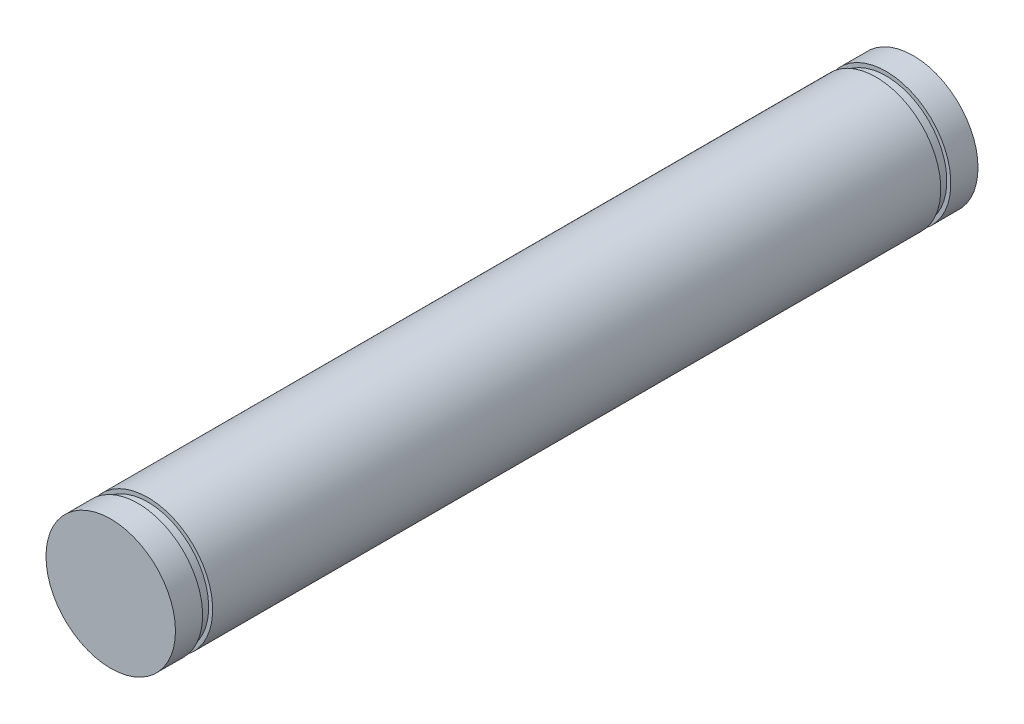
ISO-10303-21;
HEADER;
FILE_DESCRIPTION(('STEP AP214'),'2;1');
FILE_NAME('part.step','',(''),(''),'','','');
FILE_SCHEMA(('AUTOMOTIVE_DESIGN { 1 0 10303 214 1 1 1 1 }'));
ENDSEC;
DATA;
#1=APPLICATION_CONTEXT('core data for automotive mechanical design processes');
#2=APPLICATION_PROTOCOL_DEFINITION('international standard','automotive_design',2000,#1);
#3=PRODUCT_CONTEXT('',#1,'mechanical');
#4=PRODUCT('Part','Part','',(#3));
#5=PRODUCT_RELATED_PRODUCT_CATEGORY('part','',(#4));
#6=PRODUCT_DEFINITION_FORMATION('','',#4);
#7=PRODUCT_DEFINITION_CONTEXT('part definition',#1,'design');
#8=PRODUCT_DEFINITION('design','',#6,#7);
#9=PRODUCT_DEFINITION_SHAPE('','',#8);
#10=(LENGTH_UNIT() NAMED_UNIT(*) SI_UNIT(.MILLI.,.METRE.));
#11=(NAMED_UNIT(*) PLANE_ANGLE_UNIT() SI_UNIT($,.RADIAN.));
#12=(NAMED_UNIT(*) SI_UNIT($,.STERADIAN.) SOLID_ANGLE_UNIT());
#13=UNCERTAINTY_MEASURE_WITH_UNIT(LENGTH_MEASURE(1.E-05),#10,'distance_accuracy_value','');
#14=(GEOMETRIC_REPRESENTATION_CONTEXT(3) GLOBAL_UNCERTAINTY_ASSIGNED_CONTEXT((#13)) GLOBAL_UNIT_ASSIGNED_CONTEXT((#10,
#11,#12)) REPRESENTATION_CONTEXT('',''));
#15=CARTESIAN_POINT('',(0.,0.,0.));
#16=DIRECTION('',(0.,0.,1.));
#17=DIRECTION('',(1.,0.,0.));
#18=AXIS2_PLACEMENT_3D('',#15,#16,#17);
#19=CARTESIAN_POINT('',(0.,0.,59.05));
#20=DIRECTION('',(0.,0.,-1.));
#21=DIRECTION('',(-1.,0.,0.));
#22=AXIS2_PLACEMENT_3D('',#19,#20,#21);
#23=CYLINDRICAL_SURFACE('',#22,4.7625);
#24=CARTESIAN_POINT('',(0.,0.,2.));
#25=DIRECTION('',(0.,0.,-1.));
#26=DIRECTION('',(-1.,0.,0.));
#27=AXIS2_PLACEMENT_3D('',#24,#25,#26);
#28=CIRCLE('',#27,4.7625);
#29=CARTESIAN_POINT('',(-4.7625,0.,2.));
#30=VERTEX_POINT('',#29);
#31=EDGE_CURVE('E58',#30,#30,#28,.T.);
#32=ORIENTED_EDGE('',*,*,#31,.T.);
#33=EDGE_LOOP('',(#32));
#34=FACE_BOUND('',#33,.T.);
#35=CARTESIAN_POINT('',(0.,0.,0.));
#36=DIRECTION('',(0.,0.,1.));
#37=DIRECTION('',(1.,0.,0.));
#38=AXIS2_PLACEMENT_3D('',#35,#36,#37);
#39=CIRCLE('',#38,4.7625);
#40=CARTESIAN_POINT('',(4.7625,0.,0.));
#41=VERTEX_POINT('',#40);
#42=EDGE_CURVE('E51',#41,#41,#39,.T.);
#43=ORIENTED_EDGE('',*,*,#42,.T.);
#44=EDGE_LOOP('',(#43));
#45=FACE_BOUND('',#44,.T.);
#46=ADVANCED_FACE('F47',(#34,#45),#23,.T.);
#47=CARTESIAN_POINT('',(0.,0.,0.));
#48=DIRECTION('',(0.,0.,1.));
#49=DIRECTION('',(1.,0.,0.));
#50=AXIS2_PLACEMENT_3D('',#47,#48,#49);
#51=PLANE('',#50);
#52=ORIENTED_EDGE('',*,*,#42,.F.);
#53=EDGE_LOOP('',(#52));
#54=FACE_BOUND('',#53,.T.);
#55=ADVANCED_FACE('F117',(#54),#51,.F.);
#56=CARTESIAN_POINT('',(-4.7625,0.,2.));
#57=DIRECTION('',(0.,0.,-1.));
#58=DIRECTION('',(-1.,0.,0.));
#59=AXIS2_PLACEMENT_3D('',#56,#57,#58);
#60=PLANE('',#59);
#61=ORIENTED_EDGE('',*,*,#31,.F.);
#62=EDGE_LOOP('',(#61));
#63=FACE_BOUND('',#62,.T.);
#64=CARTESIAN_POINT('',(0.,0.,2.));
#65=DIRECTION('',(0.,0.,-1.));
#66=DIRECTION('',(-1.,0.,0.));
#67=AXIS2_PLACEMENT_3D('',#64,#65,#66);
#68=CIRCLE('',#67,4.4704);
#69=CARTESIAN_POINT('',(-4.4704,0.,2.));
#70=VERTEX_POINT('',#69);
#71=EDGE_CURVE('E75',#70,#70,#68,.T.);
#72=ORIENTED_EDGE('',*,*,#71,.T.);
#73=EDGE_LOOP('',(#72));
#74=FACE_BOUND('',#73,.T.);
#75=ADVANCED_FACE('F123',(#63,#74),#60,.F.);
#76=CARTESIAN_POINT('',(0.,0.,0.));
#77=DIRECTION('',(0.,0.,-1.));
#78=DIRECTION('',(-1.,0.,0.));
#79=AXIS2_PLACEMENT_3D('',#76,#77,#78);
#80=CYLINDRICAL_SURFACE('',#79,4.4704);
#81=ORIENTED_EDGE('',*,*,#71,.F.);
#82=EDGE_LOOP('',(#81));
#83=FACE_BOUND('',#82,.T.);
#84=CARTESIAN_POINT('',(0.,0.,2.7366));
#85=DIRECTION('',(0.,0.,-1.));
#86=DIRECTION('',(-1.,0.,0.));
#87=AXIS2_PLACEMENT_3D('',#84,#85,#86);
#88=CIRCLE('',#87,4.4704);
#89=CARTESIAN_POINT('',(-4.4704,0.,2.7366));
#90=VERTEX_POINT('',#89);
#91=EDGE_CURVE('E78',#90,#90,#88,.T.);
#92=ORIENTED_EDGE('',*,*,#91,.T.);
#93=EDGE_LOOP('',(#92));
#94=FACE_BOUND('',#93,.T.);
#95=ADVANCED_FACE('F130',(#83,#94),#80,.T.);
#96=CARTESIAN_POINT('',(-4.4704,0.,2.7366));
#97=DIRECTION('',(0.,0.,1.));
#98=DIRECTION('',(1.,0.,0.));
#99=AXIS2_PLACEMENT_3D('',#96,#97,#98);
#100=PLANE('',#99);
#101=ORIENTED_EDGE('',*,*,#91,.F.);
#102=EDGE_LOOP('',(#101));
#103=FACE_BOUND('',#102,.T.);
#104=CARTESIAN_POINT('',(0.,0.,2.7366));
#105=DIRECTION('',(0.,0.,-1.));
#106=DIRECTION('',(-1.,0.,0.));
#107=AXIS2_PLACEMENT_3D('',#104,#105,#106);
#108=CIRCLE('',#107,4.7625);
#109=CARTESIAN_POINT('',(-4.7625,0.,2.7366));
#110=VERTEX_POINT('',#109);
#111=EDGE_CURVE('E63',#110,#110,#108,.T.);
#112=ORIENTED_EDGE('',*,*,#111,.T.);
#113=EDGE_LOOP('',(#112));
#114=FACE_BOUND('',#113,.T.);
#115=ADVANCED_FACE('F84',(#103,#114),#100,.F.);
#116=ORIENTED_EDGE('',*,*,#111,.F.);
#117=EDGE_LOOP('',(#116));
#118=FACE_BOUND('',#117,.T.);
#119=CARTESIAN_POINT('',(0.,0.,56.3134));
#120=DIRECTION('',(0.,0.,-1.));
#121=DIRECTION('',(-1.,0.,0.));
#122=AXIS2_PLACEMENT_3D('',#119,#120,#121);
#123=CIRCLE('',#122,4.7625);
#124=CARTESIAN_POINT('',(-4.7625,0.,56.3134));
#125=VERTEX_POINT('',#124);
#126=EDGE_CURVE('E64',#125,#125,#123,.T.);
#127=ORIENTED_EDGE('',*,*,#126,.T.);
#128=EDGE_LOOP('',(#127));
#129=FACE_BOUND('',#128,.T.);
#130=ADVANCED_FACE('F86',(#118,#129),#23,.T.);
#131=CARTESIAN_POINT('',(0.,0.,0.));
#132=DIRECTION('',(0.,0.,-1.));
#133=DIRECTION('',(-1.,0.,0.));
#134=AXIS2_PLACEMENT_3D('',#131,#132,#133);
#135=CYLINDRICAL_SURFACE('',#134,4.47039999999999);
#136=CARTESIAN_POINT('',(0.,0.,56.3134));
#137=DIRECTION('',(0.,0.,-1.));
#138=DIRECTION('',(-1.,0.,0.));
#139=AXIS2_PLACEMENT_3D('',#136,#137,#138);
#140=CIRCLE('',#139,4.47039999999999);
#141=CARTESIAN_POINT('',(-4.47039999999999,0.,56.3134));
#142=VERTEX_POINT('',#141);
#143=EDGE_CURVE('E60',#142,#142,#140,.T.);
#144=ORIENTED_EDGE('',*,*,#143,.F.);
#145=EDGE_LOOP('',(#144));
#146=FACE_BOUND('',#145,.T.);
#147=CARTESIAN_POINT('',(0.,0.,57.05));
#148=DIRECTION('',(0.,0.,-1.));
#149=DIRECTION('',(-1.,0.,0.));
#150=AXIS2_PLACEMENT_3D('',#147,#148,#149);
#151=CIRCLE('',#150,4.47039999999999);
#152=CARTESIAN_POINT('',(-4.47039999999999,0.,57.05));
#153=VERTEX_POINT('',#152);
#154=EDGE_CURVE('E70',#153,#153,#151,.T.);
#155=ORIENTED_EDGE('',*,*,#154,.T.);
#156=EDGE_LOOP('',(#155));
#157=FACE_BOUND('',#156,.T.);
#158=ADVANCED_FACE('F89',(#146,#157),#135,.T.);
#159=CARTESIAN_POINT('',(-4.47039999999999,0.,56.3134));
#160=DIRECTION('',(0.,0.,-1.));
#161=DIRECTION('',(-1.,0.,0.));
#162=AXIS2_PLACEMENT_3D('',#159,#160,#161);
#163=PLANE('',#162);
#164=ORIENTED_EDGE('',*,*,#126,.F.);
#165=EDGE_LOOP('',(#164));
#166=FACE_BOUND('',#165,.T.);
#167=ORIENTED_EDGE('',*,*,#143,.T.);
#168=EDGE_LOOP('',(#167));
#169=FACE_BOUND('',#168,.T.);
#170=ADVANCED_FACE('F92',(#166,#169),#163,.F.);
#171=CARTESIAN_POINT('',(-4.7625,0.,57.05));
#172=DIRECTION('',(0.,0.,1.));
#173=DIRECTION('',(1.,0.,0.));
#174=AXIS2_PLACEMENT_3D('',#171,#172,#173);
#175=PLANE('',#174);
#176=ORIENTED_EDGE('',*,*,#154,.F.);
#177=EDGE_LOOP('',(#176));
#178=FACE_BOUND('',#177,.T.);
#179=CARTESIAN_POINT('',(0.,0.,57.05));
#180=DIRECTION('',(0.,0.,-1.));
#181=DIRECTION('',(-1.,0.,0.));
#182=AXIS2_PLACEMENT_3D('',#179,#180,#181);
#183=CIRCLE('',#182,4.7625);
#184=CARTESIAN_POINT('',(-4.7625,0.,57.05));
#185=VERTEX_POINT('',#184);
#186=EDGE_CURVE('E67',#185,#185,#183,.T.);
#187=ORIENTED_EDGE('',*,*,#186,.T.);
#188=EDGE_LOOP('',(#187));
#189=FACE_BOUND('',#188,.T.);
#190=ADVANCED_FACE('F95',(#178,#189),#175,.F.);
#191=CARTESIAN_POINT('',(0.,0.,59.05));
#192=DIRECTION('',(0.,0.,1.));
#193=DIRECTION('',(1.,0.,0.));
#194=AXIS2_PLACEMENT_3D('',#191,#192,#193);
#195=PLANE('',#194);
#196=CARTESIAN_POINT('',(0.,0.,59.05));
#197=DIRECTION('',(0.,0.,1.));
#198=DIRECTION('',(1.,0.,0.));
#199=AXIS2_PLACEMENT_3D('',#196,#197,#198);
#200=CIRCLE('',#199,4.7625);
#201=CARTESIAN_POINT('',(4.7625,0.,59.05));
#202=VERTEX_POINT('',#201);
#203=EDGE_CURVE('E10',#202,#202,#200,.T.);
#204=ORIENTED_EDGE('',*,*,#203,.T.);
#205=EDGE_LOOP('',(#204));
#206=FACE_BOUND('',#205,.T.);
#207=ADVANCED_FACE('F106',(#206),#195,.T.);
#208=ORIENTED_EDGE('',*,*,#186,.F.);
#209=EDGE_LOOP('',(#208));
#210=FACE_BOUND('',#209,.T.);
#211=ORIENTED_EDGE('',*,*,#203,.F.);
#212=EDGE_LOOP('',(#211));
#213=FACE_BOUND('',#212,.T.);
#214=ADVANCED_FACE('F49',(#210,#213),#23,.T.);
#215=CLOSED_SHELL('',(#46,#55,#75,#95,#115,#130,#158,#170,#190,#207,#214));
#216=MANIFOLD_SOLID_BREP('B2',#215);
#217=ADVANCED_BREP_SHAPE_REPRESENTATION('',(#18,#216),#14);
#218=SHAPE_DEFINITION_REPRESENTATION(#9,#217);
ENDSEC;
END-ISO-10303-21;
